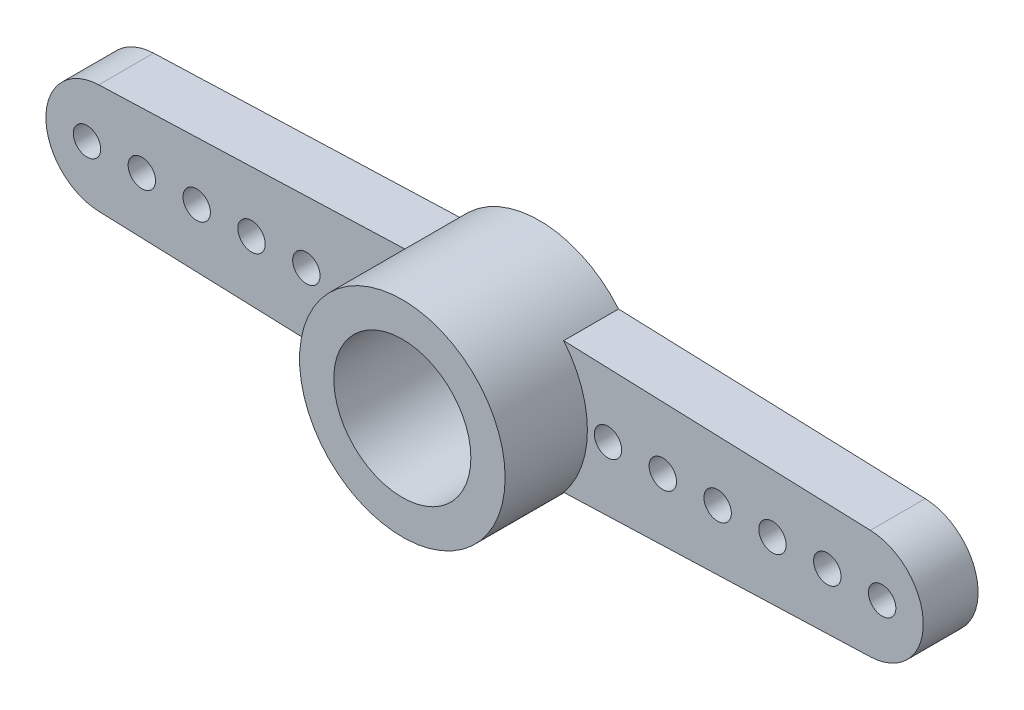
ISO-10303-21;
HEADER;
FILE_DESCRIPTION(('STEP AP214'),'2;1');
FILE_NAME('part.step','',(''),(''),'','','');
FILE_SCHEMA(('AUTOMOTIVE_DESIGN { 1 0 10303 214 1 1 1 1 }'));
ENDSEC;
DATA;
#1=APPLICATION_CONTEXT('core data for automotive mechanical design processes');
#2=APPLICATION_PROTOCOL_DEFINITION('international standard','automotive_design',2000,#1);
#3=PRODUCT_CONTEXT('',#1,'mechanical');
#4=PRODUCT('Part','Part','',(#3));
#5=PRODUCT_RELATED_PRODUCT_CATEGORY('part','',(#4));
#6=PRODUCT_DEFINITION_FORMATION('','',#4);
#7=PRODUCT_DEFINITION_CONTEXT('part definition',#1,'design');
#8=PRODUCT_DEFINITION('design','',#6,#7);
#9=PRODUCT_DEFINITION_SHAPE('','',#8);
#10=(LENGTH_UNIT() NAMED_UNIT(*) SI_UNIT(.MILLI.,.METRE.));
#11=(NAMED_UNIT(*) PLANE_ANGLE_UNIT() SI_UNIT($,.RADIAN.));
#12=(NAMED_UNIT(*) SI_UNIT($,.STERADIAN.) SOLID_ANGLE_UNIT());
#13=UNCERTAINTY_MEASURE_WITH_UNIT(LENGTH_MEASURE(1.E-05),#10,'distance_accuracy_value','');
#14=(GEOMETRIC_REPRESENTATION_CONTEXT(3) GLOBAL_UNCERTAINTY_ASSIGNED_CONTEXT((#13)) GLOBAL_UNIT_ASSIGNED_CONTEXT((#10,
#11,#12)) REPRESENTATION_CONTEXT('',''));
#15=CARTESIAN_POINT('',(0.,0.,0.));
#16=DIRECTION('',(0.,0.,1.));
#17=DIRECTION('',(1.,0.,0.));
#18=AXIS2_PLACEMENT_3D('',#15,#16,#17);
#19=CARTESIAN_POINT('',(0.,0.,0.));
#20=DIRECTION('',(0.,0.,1.));
#21=DIRECTION('',(1.,0.,0.));
#22=AXIS2_PLACEMENT_3D('',#19,#20,#21);
#23=CYLINDRICAL_SURFACE('',#22,2.5);
#24=CARTESIAN_POINT('',(0.,0.,5.));
#25=DIRECTION('',(0.,0.,1.));
#26=DIRECTION('',(1.,0.,0.));
#27=AXIS2_PLACEMENT_3D('',#24,#25,#26);
#28=CIRCLE('',#27,2.5);
#29=CARTESIAN_POINT('',(2.5,0.,5.));
#30=VERTEX_POINT('',#29);
#31=EDGE_CURVE('E540',#30,#30,#28,.T.);
#32=ORIENTED_EDGE('',*,*,#31,.T.);
#33=EDGE_LOOP('',(#32));
#34=FACE_BOUND('',#33,.T.);
#35=CARTESIAN_POINT('',(0.,0.,1.));
#36=DIRECTION('',(0.,0.,-1.));
#37=DIRECTION('',(-1.,0.,0.));
#38=AXIS2_PLACEMENT_3D('',#35,#36,#37);
#39=CIRCLE('',#38,2.5);
#40=CARTESIAN_POINT('',(-2.5,0.,1.));
#41=VERTEX_POINT('',#40);
#42=EDGE_CURVE('E466',#41,#41,#39,.T.);
#43=ORIENTED_EDGE('',*,*,#42,.T.);
#44=EDGE_LOOP('',(#43));
#45=FACE_BOUND('',#44,.T.);
#46=ADVANCED_FACE('F42',(#34,#45),#23,.F.);
#47=CARTESIAN_POINT('',(0.,0.,2.));
#48=DIRECTION('',(0.,0.,1.));
#49=DIRECTION('',(1.,0.,0.));
#50=AXIS2_PLACEMENT_3D('',#47,#48,#49);
#51=PLANE('',#50);
#52=CARTESIAN_POINT('',(-12.5,0.,2.));
#53=DIRECTION('',(0.,0.,-1.));
#54=DIRECTION('',(-1.,0.,0.));
#55=AXIS2_PLACEMENT_3D('',#52,#53,#54);
#56=CIRCLE('',#55,0.500000000000001);
#57=CARTESIAN_POINT('',(-13.,0.,2.));
#58=VERTEX_POINT('',#57);
#59=EDGE_CURVE('E480',#58,#58,#56,.F.);
#60=ORIENTED_EDGE('',*,*,#59,.F.);
#61=EDGE_LOOP('',(#60));
#62=FACE_BOUND('',#61,.T.);
#63=CARTESIAN_POINT('',(-8.5,0.,2.));
#64=DIRECTION('',(0.,0.,-1.));
#65=DIRECTION('',(-1.,0.,0.));
#66=AXIS2_PLACEMENT_3D('',#63,#64,#65);
#67=CIRCLE('',#66,0.500000000000001);
#68=CARTESIAN_POINT('',(-9.,0.,2.));
#69=VERTEX_POINT('',#68);
#70=EDGE_CURVE('E492',#69,#69,#67,.F.);
#71=ORIENTED_EDGE('',*,*,#70,.F.);
#72=EDGE_LOOP('',(#71));
#73=FACE_BOUND('',#72,.T.);
#74=CARTESIAN_POINT('',(-4.5,0.,2.));
#75=DIRECTION('',(0.,0.,-1.));
#76=DIRECTION('',(-1.,0.,0.));
#77=AXIS2_PLACEMENT_3D('',#74,#75,#76);
#78=CIRCLE('',#77,0.500000000000001);
#79=CARTESIAN_POINT('',(-5.,0.,2.));
#80=VERTEX_POINT('',#79);
#81=EDGE_CURVE('E504',#80,#80,#78,.F.);
#82=ORIENTED_EDGE('',*,*,#81,.F.);
#83=EDGE_LOOP('',(#82));
#84=FACE_BOUND('',#83,.T.);
#85=CARTESIAN_POINT('',(0.,0.,2.));
#86=DIRECTION('',(0.,0.,1.));
#87=DIRECTION('',(1.,0.,0.));
#88=AXIS2_PLACEMENT_3D('',#85,#86,#87);
#89=CIRCLE('',#88,3.75);
#90=CARTESIAN_POINT('',(-2.88547071027724,2.39511143376089,2.));
#91=VERTEX_POINT('',#90);
#92=CARTESIAN_POINT('',(-2.88547071027724,-2.39511143376089,2.));
#93=VERTEX_POINT('',#92);
#94=EDGE_CURVE('E12',#91,#93,#89,.T.);
#95=ORIENTED_EDGE('',*,*,#94,.F.);
#96=DIRECTION('',(0.999372730394994,0.0354139201848026,0.));
#97=VECTOR('',#96,1.);
#98=CARTESIAN_POINT('',(-0.0883858807695831,2.49422934631706,2.));
#99=LINE('',#98,#97);
#100=CARTESIAN_POINT('',(-14.0708278403696,1.99874546078999,2.));
#101=VERTEX_POINT('',#100);
#102=EDGE_CURVE('E187',#101,#91,#99,.T.);
#103=ORIENTED_EDGE('',*,*,#102,.F.);
#104=CARTESIAN_POINT('',(-14.,0.,2.));
#105=DIRECTION('',(0.,0.,1.));
#106=DIRECTION('',(1.,0.,0.));
#107=AXIS2_PLACEMENT_3D('',#104,#105,#106);
#108=CIRCLE('',#107,2.);
#109=CARTESIAN_POINT('',(-14.0708278403696,-1.99874546078999,2.));
#110=VERTEX_POINT('',#109);
#111=EDGE_CURVE('E180',#110,#101,#108,.F.);
#112=ORIENTED_EDGE('',*,*,#111,.F.);
#113=DIRECTION('',(0.999372730394994,-0.0354139201848024,0.));
#114=VECTOR('',#113,1.);
#115=CARTESIAN_POINT('',(-0.0883858807695825,-2.49422934631706,2.));
#116=LINE('',#115,#114);
#117=EDGE_CURVE('E184',#110,#93,#116,.T.);
#118=ORIENTED_EDGE('',*,*,#117,.T.);
#119=EDGE_LOOP('',(#95,#103,#112,#118));
#120=FACE_BOUND('',#119,.T.);
#121=CARTESIAN_POINT('',(-6.5,0.,2.));
#122=DIRECTION('',(0.,0.,-1.));
#123=DIRECTION('',(-1.,0.,0.));
#124=AXIS2_PLACEMENT_3D('',#121,#122,#123);
#125=CIRCLE('',#124,0.500000000000001);
#126=CARTESIAN_POINT('',(-7.,0.,2.));
#127=VERTEX_POINT('',#126);
#128=EDGE_CURVE('E498',#127,#127,#125,.F.);
#129=ORIENTED_EDGE('',*,*,#128,.F.);
#130=EDGE_LOOP('',(#129));
#131=FACE_BOUND('',#130,.T.);
#132=CARTESIAN_POINT('',(-10.5,0.,2.));
#133=DIRECTION('',(0.,0.,-1.));
#134=DIRECTION('',(-1.,0.,0.));
#135=AXIS2_PLACEMENT_3D('',#132,#133,#134);
#136=CIRCLE('',#135,0.500000000000001);
#137=CARTESIAN_POINT('',(-11.,0.,2.));
#138=VERTEX_POINT('',#137);
#139=EDGE_CURVE('E486',#138,#138,#136,.F.);
#140=ORIENTED_EDGE('',*,*,#139,.F.);
#141=EDGE_LOOP('',(#140));
#142=FACE_BOUND('',#141,.T.);
#143=CARTESIAN_POINT('',(-14.5,0.,2.));
#144=DIRECTION('',(0.,0.,-1.));
#145=DIRECTION('',(-1.,0.,0.));
#146=AXIS2_PLACEMENT_3D('',#143,#144,#145);
#147=CIRCLE('',#146,0.500000000000001);
#148=CARTESIAN_POINT('',(-15.,0.,2.));
#149=VERTEX_POINT('',#148);
#150=EDGE_CURVE('E474',#149,#149,#147,.F.);
#151=ORIENTED_EDGE('',*,*,#150,.F.);
#152=EDGE_LOOP('',(#151));
#153=FACE_BOUND('',#152,.T.);
#154=ADVANCED_FACE('F188',(#62,#73,#84,#120,#131,#142,#153),#51,.T.);
#155=CARTESIAN_POINT('',(0.,0.,0.));
#156=DIRECTION('',(0.,0.,1.));
#157=DIRECTION('',(1.,0.,0.));
#158=AXIS2_PLACEMENT_3D('',#155,#156,#157);
#159=PLANE('',#158);
#160=CARTESIAN_POINT('',(0.,0.,0.));
#161=DIRECTION('',(0.,0.,-1.));
#162=DIRECTION('',(-1.,0.,0.));
#163=AXIS2_PLACEMENT_3D('',#160,#161,#162);
#164=CIRCLE('',#163,2.5);
#165=CARTESIAN_POINT('',(-2.5,0.,0.));
#166=VERTEX_POINT('',#165);
#167=EDGE_CURVE('E458',#166,#166,#164,.T.);
#168=ORIENTED_EDGE('',*,*,#167,.F.);
#169=EDGE_LOOP('',(#168));
#170=FACE_BOUND('',#169,.T.);
#171=CARTESIAN_POINT('',(12.5,0.,0.));
#172=DIRECTION('',(0.,0.,-1.));
#173=DIRECTION('',(-1.,0.,0.));
#174=AXIS2_PLACEMENT_3D('',#171,#172,#173);
#175=CIRCLE('',#174,0.500000000000001);
#176=CARTESIAN_POINT('',(12.,0.,0.));
#177=VERTEX_POINT('',#176);
#178=EDGE_CURVE('E471',#177,#177,#175,.T.);
#179=ORIENTED_EDGE('',*,*,#178,.F.);
#180=EDGE_LOOP('',(#179));
#181=FACE_BOUND('',#180,.T.);
#182=CARTESIAN_POINT('',(-12.5,0.,0.));
#183=DIRECTION('',(0.,0.,-1.));
#184=DIRECTION('',(-1.,0.,0.));
#185=AXIS2_PLACEMENT_3D('',#182,#183,#184);
#186=CIRCLE('',#185,0.500000000000001);
#187=CARTESIAN_POINT('',(-13.,0.,0.));
#188=VERTEX_POINT('',#187);
#189=EDGE_CURVE('E483',#188,#188,#186,.F.);
#190=ORIENTED_EDGE('',*,*,#189,.T.);
#191=EDGE_LOOP('',(#190));
#192=FACE_BOUND('',#191,.T.);
#193=CARTESIAN_POINT('',(-8.5,0.,0.));
#194=DIRECTION('',(0.,0.,-1.));
#195=DIRECTION('',(-1.,0.,0.));
#196=AXIS2_PLACEMENT_3D('',#193,#194,#195);
#197=CIRCLE('',#196,0.500000000000001);
#198=CARTESIAN_POINT('',(-9.,0.,0.));
#199=VERTEX_POINT('',#198);
#200=EDGE_CURVE('E495',#199,#199,#197,.F.);
#201=ORIENTED_EDGE('',*,*,#200,.T.);
#202=EDGE_LOOP('',(#201));
#203=FACE_BOUND('',#202,.T.);
#204=CARTESIAN_POINT('',(-4.5,0.,0.));
#205=DIRECTION('',(0.,0.,-1.));
#206=DIRECTION('',(-1.,0.,0.));
#207=AXIS2_PLACEMENT_3D('',#204,#205,#206);
#208=CIRCLE('',#207,0.500000000000001);
#209=CARTESIAN_POINT('',(-5.,0.,0.));
#210=VERTEX_POINT('',#209);
#211=EDGE_CURVE('E507',#210,#210,#208,.F.);
#212=ORIENTED_EDGE('',*,*,#211,.T.);
#213=EDGE_LOOP('',(#212));
#214=FACE_BOUND('',#213,.T.);
#215=CARTESIAN_POINT('',(4.5,0.,0.));
#216=DIRECTION('',(0.,0.,-1.));
#217=DIRECTION('',(-1.,0.,0.));
#218=AXIS2_PLACEMENT_3D('',#215,#216,#217);
#219=CIRCLE('',#218,0.500000000000001);
#220=CARTESIAN_POINT('',(4.,0.,0.));
#221=VERTEX_POINT('',#220);
#222=EDGE_CURVE('E513',#221,#221,#219,.T.);
#223=ORIENTED_EDGE('',*,*,#222,.F.);
#224=EDGE_LOOP('',(#223));
#225=FACE_BOUND('',#224,.T.);
#226=CARTESIAN_POINT('',(6.5,0.,0.));
#227=DIRECTION('',(0.,0.,-1.));
#228=DIRECTION('',(-1.,0.,0.));
#229=AXIS2_PLACEMENT_3D('',#226,#227,#228);
#230=CIRCLE('',#229,0.500000000000001);
#231=CARTESIAN_POINT('',(6.,0.,0.));
#232=VERTEX_POINT('',#231);
#233=EDGE_CURVE('E519',#232,#232,#230,.T.);
#234=ORIENTED_EDGE('',*,*,#233,.F.);
#235=EDGE_LOOP('',(#234));
#236=FACE_BOUND('',#235,.T.);
#237=CARTESIAN_POINT('',(8.5,0.,0.));
#238=DIRECTION('',(0.,0.,-1.));
#239=DIRECTION('',(-1.,0.,0.));
#240=AXIS2_PLACEMENT_3D('',#237,#238,#239);
#241=CIRCLE('',#240,0.500000000000001);
#242=CARTESIAN_POINT('',(8.,0.,0.));
#243=VERTEX_POINT('',#242);
#244=EDGE_CURVE('E525',#243,#243,#241,.T.);
#245=ORIENTED_EDGE('',*,*,#244,.F.);
#246=EDGE_LOOP('',(#245));
#247=FACE_BOUND('',#246,.T.);
#248=CARTESIAN_POINT('',(10.5,0.,0.));
#249=DIRECTION('',(0.,0.,-1.));
#250=DIRECTION('',(-1.,0.,0.));
#251=AXIS2_PLACEMENT_3D('',#248,#249,#250);
#252=CIRCLE('',#251,0.500000000000001);
#253=CARTESIAN_POINT('',(10.,0.,0.));
#254=VERTEX_POINT('',#253);
#255=EDGE_CURVE('E531',#254,#254,#252,.T.);
#256=ORIENTED_EDGE('',*,*,#255,.F.);
#257=EDGE_LOOP('',(#256));
#258=FACE_BOUND('',#257,.T.);
#259=CARTESIAN_POINT('',(14.5,0.,0.));
#260=DIRECTION('',(0.,0.,-1.));
#261=DIRECTION('',(-1.,0.,0.));
#262=AXIS2_PLACEMENT_3D('',#259,#260,#261);
#263=CIRCLE('',#262,0.500000000000001);
#264=CARTESIAN_POINT('',(14.,0.,0.));
#265=VERTEX_POINT('',#264);
#266=EDGE_CURVE('E534',#265,#265,#263,.T.);
#267=ORIENTED_EDGE('',*,*,#266,.F.);
#268=EDGE_LOOP('',(#267));
#269=FACE_BOUND('',#268,.T.);
#270=DIRECTION('',(-0.999372730394994,-0.0354139201848029,0.));
#271=VECTOR('',#270,1.);
#272=CARTESIAN_POINT('',(0.0883858807695838,-2.49422934631706,0.));
#273=LINE('',#272,#271);
#274=CARTESIAN_POINT('',(14.0708278403696,-1.99874546078998,0.));
#275=VERTEX_POINT('',#274);
#276=CARTESIAN_POINT('',(2.88547071027724,-2.39511143376089,0.));
#277=VERTEX_POINT('',#276);
#278=EDGE_CURVE('E116',#275,#277,#273,.T.);
#279=ORIENTED_EDGE('',*,*,#278,.T.);
#280=CARTESIAN_POINT('',(0.,0.,0.));
#281=DIRECTION('',(0.,0.,-1.));
#282=DIRECTION('',(-1.,0.,0.));
#283=AXIS2_PLACEMENT_3D('',#280,#281,#282);
#284=CIRCLE('',#283,3.75);
#285=CARTESIAN_POINT('',(-2.88547071027724,-2.39511143376089,0.));
#286=VERTEX_POINT('',#285);
#287=EDGE_CURVE('E93',#277,#286,#284,.T.);
#288=ORIENTED_EDGE('',*,*,#287,.T.);
#289=DIRECTION('',(0.999372730394994,-0.0354139201848024,0.));
#290=VECTOR('',#289,1.);
#291=CARTESIAN_POINT('',(-0.0883858807695825,-2.49422934631706,0.));
#292=LINE('',#291,#290);
#293=CARTESIAN_POINT('',(-14.0708278403696,-1.99874546078999,0.));
#294=VERTEX_POINT('',#293);
#295=EDGE_CURVE('E150',#294,#286,#292,.T.);
#296=ORIENTED_EDGE('',*,*,#295,.F.);
#297=CARTESIAN_POINT('',(-14.,0.,0.));
#298=DIRECTION('',(0.,0.,1.));
#299=DIRECTION('',(1.,0.,0.));
#300=AXIS2_PLACEMENT_3D('',#297,#298,#299);
#301=CIRCLE('',#300,2.);
#302=CARTESIAN_POINT('',(-14.0708278403696,1.99874546078999,0.));
#303=VERTEX_POINT('',#302);
#304=EDGE_CURVE('E182',#294,#303,#301,.F.);
#305=ORIENTED_EDGE('',*,*,#304,.T.);
#306=DIRECTION('',(0.999372730394994,0.0354139201848026,0.));
#307=VECTOR('',#306,1.);
#308=CARTESIAN_POINT('',(-0.0883858807695831,2.49422934631706,0.));
#309=LINE('',#308,#307);
#310=CARTESIAN_POINT('',(-2.88547071027724,2.39511143376089,0.));
#311=VERTEX_POINT('',#310);
#312=EDGE_CURVE('E59',#303,#311,#309,.T.);
#313=ORIENTED_EDGE('',*,*,#312,.T.);
#314=CARTESIAN_POINT('',(2.88547071027724,2.39511143376089,0.));
#315=VERTEX_POINT('',#314);
#316=EDGE_CURVE('E83',#311,#315,#284,.T.);
#317=ORIENTED_EDGE('',*,*,#316,.T.);
#318=DIRECTION('',(-0.999372730394994,0.0354139201848023,0.));
#319=VECTOR('',#318,1.);
#320=CARTESIAN_POINT('',(0.0883858807695825,2.49422934631706,0.));
#321=LINE('',#320,#319);
#322=CARTESIAN_POINT('',(14.0708278403696,1.99874546078999,0.));
#323=VERTEX_POINT('',#322);
#324=EDGE_CURVE('E90',#323,#315,#321,.T.);
#325=ORIENTED_EDGE('',*,*,#324,.F.);
#326=CARTESIAN_POINT('',(14.,0.,0.));
#327=DIRECTION('',(0.,0.,1.));
#328=DIRECTION('',(1.,0.,0.));
#329=AXIS2_PLACEMENT_3D('',#326,#327,#328);
#330=CIRCLE('',#329,2.);
#331=EDGE_CURVE('E112',#275,#323,#330,.T.);
#332=ORIENTED_EDGE('',*,*,#331,.F.);
#333=EDGE_LOOP('',(#279,#288,#296,#305,#313,#317,#325,#332));
#334=FACE_BOUND('',#333,.T.);
#335=CARTESIAN_POINT('',(-6.5,0.,0.));
#336=DIRECTION('',(0.,0.,-1.));
#337=DIRECTION('',(-1.,0.,0.));
#338=AXIS2_PLACEMENT_3D('',#335,#336,#337);
#339=CIRCLE('',#338,0.500000000000001);
#340=CARTESIAN_POINT('',(-7.,0.,0.));
#341=VERTEX_POINT('',#340);
#342=EDGE_CURVE('E501',#341,#341,#339,.F.);
#343=ORIENTED_EDGE('',*,*,#342,.T.);
#344=EDGE_LOOP('',(#343));
#345=FACE_BOUND('',#344,.T.);
#346=CARTESIAN_POINT('',(-10.5,0.,0.));
#347=DIRECTION('',(0.,0.,-1.));
#348=DIRECTION('',(-1.,0.,0.));
#349=AXIS2_PLACEMENT_3D('',#346,#347,#348);
#350=CIRCLE('',#349,0.500000000000001);
#351=CARTESIAN_POINT('',(-11.,0.,0.));
#352=VERTEX_POINT('',#351);
#353=EDGE_CURVE('E489',#352,#352,#350,.F.);
#354=ORIENTED_EDGE('',*,*,#353,.T.);
#355=EDGE_LOOP('',(#354));
#356=FACE_BOUND('',#355,.T.);
#357=CARTESIAN_POINT('',(-14.5,0.,0.));
#358=DIRECTION('',(0.,0.,-1.));
#359=DIRECTION('',(-1.,0.,0.));
#360=AXIS2_PLACEMENT_3D('',#357,#358,#359);
#361=CIRCLE('',#360,0.500000000000001);
#362=CARTESIAN_POINT('',(-15.,0.,0.));
#363=VERTEX_POINT('',#362);
#364=EDGE_CURVE('E477',#363,#363,#361,.F.);
#365=ORIENTED_EDGE('',*,*,#364,.T.);
#366=EDGE_LOOP('',(#365));
#367=FACE_BOUND('',#366,.T.);
#368=ADVANCED_FACE('F86',(#170,#181,#192,#203,#214,#225,#236,#247,#258,#269,#334,#345,#356,
#367),#159,.F.);
#369=CARTESIAN_POINT('',(0.0883858807695838,-2.49422934631706,2.));
#370=DIRECTION('',(0.0354139201848029,-0.999372730394994,0.));
#371=DIRECTION('',(0.999372730394994,0.0354139201848029,0.));
#372=AXIS2_PLACEMENT_3D('',#369,#370,#371);
#373=PLANE('',#372);
#374=ORIENTED_EDGE('',*,*,#278,.F.);
#375=DIRECTION('',(0.,0.,-1.));
#376=VECTOR('',#375,1.);
#377=CARTESIAN_POINT('',(14.0708278403696,-1.99874546078998,2.));
#378=LINE('',#377,#376);
#379=CARTESIAN_POINT('',(14.0708278403696,-1.99874546078998,2.));
#380=VERTEX_POINT('',#379);
#381=EDGE_CURVE('E121',#380,#275,#378,.T.);
#382=ORIENTED_EDGE('',*,*,#381,.F.);
#383=DIRECTION('',(-0.999372730394994,-0.0354139201848029,0.));
#384=VECTOR('',#383,1.);
#385=CARTESIAN_POINT('',(0.0883858807695838,-2.49422934631706,2.));
#386=LINE('',#385,#384);
#387=CARTESIAN_POINT('',(2.88547071027724,-2.39511143376089,2.));
#388=VERTEX_POINT('',#387);
#389=EDGE_CURVE('E111',#380,#388,#386,.T.);
#390=ORIENTED_EDGE('',*,*,#389,.T.);
#391=DIRECTION('',(0.,0.,-1.));
#392=VECTOR('',#391,1.);
#393=CARTESIAN_POINT('',(2.88547071027724,-2.39511143376089,2.));
#394=LINE('',#393,#392);
#395=EDGE_CURVE('E107',#388,#277,#394,.T.);
#396=ORIENTED_EDGE('',*,*,#395,.T.);
#397=EDGE_LOOP('',(#374,#382,#390,#396));
#398=FACE_BOUND('',#397,.T.);
#399=ADVANCED_FACE('F44',(#398),#373,.T.);
#400=CARTESIAN_POINT('',(14.,0.,2.));
#401=DIRECTION('',(0.,0.,-1.));
#402=DIRECTION('',(-1.,0.,0.));
#403=AXIS2_PLACEMENT_3D('',#400,#401,#402);
#404=CYLINDRICAL_SURFACE('',#403,2.);
#405=ORIENTED_EDGE('',*,*,#331,.T.);
#406=DIRECTION('',(0.,0.,-1.));
#407=VECTOR('',#406,1.);
#408=CARTESIAN_POINT('',(14.0708278403696,1.99874546078999,2.));
#409=LINE('',#408,#407);
#410=CARTESIAN_POINT('',(14.0708278403696,1.99874546078999,2.));
#411=VERTEX_POINT('',#410);
#412=EDGE_CURVE('E106',#411,#323,#409,.T.);
#413=ORIENTED_EDGE('',*,*,#412,.F.);
#414=CARTESIAN_POINT('',(14.,0.,2.));
#415=DIRECTION('',(0.,0.,1.));
#416=DIRECTION('',(1.,0.,0.));
#417=AXIS2_PLACEMENT_3D('',#414,#415,#416);
#418=CIRCLE('',#417,2.);
#419=EDGE_CURVE('E68',#380,#411,#418,.T.);
#420=ORIENTED_EDGE('',*,*,#419,.F.);
#421=ORIENTED_EDGE('',*,*,#381,.T.);
#422=EDGE_LOOP('',(#405,#413,#420,#421));
#423=FACE_BOUND('',#422,.T.);
#424=ADVANCED_FACE('F243',(#423),#404,.T.);
#425=CARTESIAN_POINT('',(0.0883858807695825,2.49422934631706,2.));
#426=DIRECTION('',(-0.0354139201848023,-0.999372730394994,0.));
#427=DIRECTION('',(0.999372730394994,-0.0354139201848023,0.));
#428=AXIS2_PLACEMENT_3D('',#425,#426,#427);
#429=PLANE('',#428);
#430=ORIENTED_EDGE('',*,*,#324,.T.);
#431=DIRECTION('',(0.,0.,-1.));
#432=VECTOR('',#431,1.);
#433=CARTESIAN_POINT('',(2.88547071027724,2.39511143376089,2.));
#434=LINE('',#433,#432);
#435=CARTESIAN_POINT('',(2.88547071027724,2.39511143376089,2.));
#436=VERTEX_POINT('',#435);
#437=EDGE_CURVE('E98',#436,#315,#434,.T.);
#438=ORIENTED_EDGE('',*,*,#437,.F.);
#439=DIRECTION('',(-0.999372730394994,0.0354139201848023,0.));
#440=VECTOR('',#439,1.);
#441=CARTESIAN_POINT('',(0.0883858807695825,2.49422934631706,2.));
#442=LINE('',#441,#440);
#443=EDGE_CURVE('E135',#411,#436,#442,.T.);
#444=ORIENTED_EDGE('',*,*,#443,.F.);
#445=ORIENTED_EDGE('',*,*,#412,.T.);
#446=EDGE_LOOP('',(#430,#438,#444,#445));
#447=FACE_BOUND('',#446,.T.);
#448=ADVANCED_FACE('F110',(#447),#429,.F.);
#449=CARTESIAN_POINT('',(12.5,0.,2.));
#450=DIRECTION('',(0.,0.,-1.));
#451=DIRECTION('',(-1.,0.,0.));
#452=AXIS2_PLACEMENT_3D('',#449,#450,#451);
#453=CIRCLE('',#452,0.500000000000001);
#454=CARTESIAN_POINT('',(12.,0.,2.));
#455=VERTEX_POINT('',#454);
#456=EDGE_CURVE('E470',#455,#455,#453,.T.);
#457=ORIENTED_EDGE('',*,*,#456,.T.);
#458=EDGE_LOOP('',(#457));
#459=FACE_BOUND('',#458,.T.);
#460=CARTESIAN_POINT('',(4.5,0.,2.));
#461=DIRECTION('',(0.,0.,-1.));
#462=DIRECTION('',(-1.,0.,0.));
#463=AXIS2_PLACEMENT_3D('',#460,#461,#462);
#464=CIRCLE('',#463,0.500000000000001);
#465=CARTESIAN_POINT('',(4.,0.,2.));
#466=VERTEX_POINT('',#465);
#467=EDGE_CURVE('E510',#466,#466,#464,.T.);
#468=ORIENTED_EDGE('',*,*,#467,.T.);
#469=EDGE_LOOP('',(#468));
#470=FACE_BOUND('',#469,.T.);
#471=CARTESIAN_POINT('',(6.5,0.,2.));
#472=DIRECTION('',(0.,0.,-1.));
#473=DIRECTION('',(-1.,0.,0.));
#474=AXIS2_PLACEMENT_3D('',#471,#472,#473);
#475=CIRCLE('',#474,0.500000000000001);
#476=CARTESIAN_POINT('',(6.,0.,2.));
#477=VERTEX_POINT('',#476);
#478=EDGE_CURVE('E516',#477,#477,#475,.T.);
#479=ORIENTED_EDGE('',*,*,#478,.T.);
#480=EDGE_LOOP('',(#479));
#481=FACE_BOUND('',#480,.T.);
#482=CARTESIAN_POINT('',(8.5,0.,2.));
#483=DIRECTION('',(0.,0.,-1.));
#484=DIRECTION('',(-1.,0.,0.));
#485=AXIS2_PLACEMENT_3D('',#482,#483,#484);
#486=CIRCLE('',#485,0.500000000000001);
#487=CARTESIAN_POINT('',(8.,0.,2.));
#488=VERTEX_POINT('',#487);
#489=EDGE_CURVE('E522',#488,#488,#486,.T.);
#490=ORIENTED_EDGE('',*,*,#489,.T.);
#491=EDGE_LOOP('',(#490));
#492=FACE_BOUND('',#491,.T.);
#493=CARTESIAN_POINT('',(10.5,0.,2.));
#494=DIRECTION('',(0.,0.,-1.));
#495=DIRECTION('',(-1.,0.,0.));
#496=AXIS2_PLACEMENT_3D('',#493,#494,#495);
#497=CIRCLE('',#496,0.500000000000001);
#498=CARTESIAN_POINT('',(10.,0.,2.));
#499=VERTEX_POINT('',#498);
#500=EDGE_CURVE('E528',#499,#499,#497,.T.);
#501=ORIENTED_EDGE('',*,*,#500,.T.);
#502=EDGE_LOOP('',(#501));
#503=FACE_BOUND('',#502,.T.);
#504=CARTESIAN_POINT('',(14.5,0.,2.));
#505=DIRECTION('',(0.,0.,-1.));
#506=DIRECTION('',(-1.,0.,0.));
#507=AXIS2_PLACEMENT_3D('',#504,#505,#506);
#508=CIRCLE('',#507,0.500000000000001);
#509=CARTESIAN_POINT('',(14.,0.,2.));
#510=VERTEX_POINT('',#509);
#511=EDGE_CURVE('E537',#510,#510,#508,.T.);
#512=ORIENTED_EDGE('',*,*,#511,.T.);
#513=EDGE_LOOP('',(#512));
#514=FACE_BOUND('',#513,.T.);
#515=EDGE_CURVE('E51',#388,#436,#89,.T.);
#516=ORIENTED_EDGE('',*,*,#515,.F.);
#517=ORIENTED_EDGE('',*,*,#389,.F.);
#518=ORIENTED_EDGE('',*,*,#419,.T.);
#519=ORIENTED_EDGE('',*,*,#443,.T.);
#520=EDGE_LOOP('',(#516,#517,#518,#519));
#521=FACE_BOUND('',#520,.T.);
#522=ADVANCED_FACE('F230',(#459,#470,#481,#492,#503,#514,#521),#51,.T.);
#523=CARTESIAN_POINT('',(0.,0.,0.));
#524=DIRECTION('',(0.,0.,1.));
#525=DIRECTION('',(1.,0.,0.));
#526=AXIS2_PLACEMENT_3D('',#523,#524,#525);
#527=CYLINDRICAL_SURFACE('',#526,3.75);
#528=ORIENTED_EDGE('',*,*,#316,.F.);
#529=DIRECTION('',(0.,0.,-1.));
#530=VECTOR('',#529,1.);
#531=CARTESIAN_POINT('',(-2.88547071027724,2.39511143376089,2.));
#532=LINE('',#531,#530);
#533=EDGE_CURVE('E200',#91,#311,#532,.T.);
#534=ORIENTED_EDGE('',*,*,#533,.F.);
#535=ORIENTED_EDGE('',*,*,#94,.T.);
#536=DIRECTION('',(0.,0.,-1.));
#537=VECTOR('',#536,1.);
#538=CARTESIAN_POINT('',(-2.88547071027724,-2.39511143376089,2.));
#539=LINE('',#538,#537);
#540=EDGE_CURVE('E156',#93,#286,#539,.T.);
#541=ORIENTED_EDGE('',*,*,#540,.T.);
#542=ORIENTED_EDGE('',*,*,#287,.F.);
#543=ORIENTED_EDGE('',*,*,#395,.F.);
#544=ORIENTED_EDGE('',*,*,#515,.T.);
#545=ORIENTED_EDGE('',*,*,#437,.T.);
#546=EDGE_LOOP('',(#528,#534,#535,#541,#542,#543,#544,#545));
#547=FACE_BOUND('',#546,.T.);
#548=CARTESIAN_POINT('',(0.,0.,5.));
#549=DIRECTION('',(0.,0.,1.));
#550=DIRECTION('',(1.,0.,0.));
#551=AXIS2_PLACEMENT_3D('',#548,#549,#550);
#552=CIRCLE('',#551,3.75);
#553=CARTESIAN_POINT('',(3.75,0.,5.));
#554=VERTEX_POINT('',#553);
#555=EDGE_CURVE('E195',#554,#554,#552,.T.);
#556=ORIENTED_EDGE('',*,*,#555,.F.);
#557=EDGE_LOOP('',(#556));
#558=FACE_BOUND('',#557,.T.);
#559=ADVANCED_FACE('F99',(#547,#558),#527,.T.);
#560=CARTESIAN_POINT('',(-14.,0.,2.));
#561=DIRECTION('',(0.,0.,-1.));
#562=DIRECTION('',(-1.,0.,0.));
#563=AXIS2_PLACEMENT_3D('',#560,#561,#562);
#564=CYLINDRICAL_SURFACE('',#563,2.);
#565=ORIENTED_EDGE('',*,*,#304,.F.);
#566=DIRECTION('',(0.,0.,-1.));
#567=VECTOR('',#566,1.);
#568=CARTESIAN_POINT('',(-14.0708278403696,-1.99874546078999,2.));
#569=LINE('',#568,#567);
#570=EDGE_CURVE('E94',#110,#294,#569,.T.);
#571=ORIENTED_EDGE('',*,*,#570,.F.);
#572=ORIENTED_EDGE('',*,*,#111,.T.);
#573=DIRECTION('',(0.,0.,-1.));
#574=VECTOR('',#573,1.);
#575=CARTESIAN_POINT('',(-14.0708278403696,1.99874546078999,2.));
#576=LINE('',#575,#574);
#577=EDGE_CURVE('E199',#101,#303,#576,.T.);
#578=ORIENTED_EDGE('',*,*,#577,.T.);
#579=EDGE_LOOP('',(#565,#571,#572,#578));
#580=FACE_BOUND('',#579,.T.);
#581=ADVANCED_FACE('F178',(#580),#564,.T.);
#582=CARTESIAN_POINT('',(-0.0883858807695825,-2.49422934631706,2.));
#583=DIRECTION('',(0.0354139201848024,0.999372730394994,0.));
#584=DIRECTION('',(-0.999372730394994,0.0354139201848024,0.));
#585=AXIS2_PLACEMENT_3D('',#582,#583,#584);
#586=PLANE('',#585);
#587=ORIENTED_EDGE('',*,*,#295,.T.);
#588=ORIENTED_EDGE('',*,*,#540,.F.);
#589=ORIENTED_EDGE('',*,*,#117,.F.);
#590=ORIENTED_EDGE('',*,*,#570,.T.);
#591=EDGE_LOOP('',(#587,#588,#589,#590));
#592=FACE_BOUND('',#591,.T.);
#593=ADVANCED_FACE('F185',(#592),#586,.F.);
#594=CARTESIAN_POINT('',(-0.0883858807695831,2.49422934631706,2.));
#595=DIRECTION('',(-0.0354139201848026,0.999372730394994,0.));
#596=DIRECTION('',(-0.999372730394994,-0.0354139201848026,0.));
#597=AXIS2_PLACEMENT_3D('',#594,#595,#596);
#598=PLANE('',#597);
#599=ORIENTED_EDGE('',*,*,#312,.F.);
#600=ORIENTED_EDGE('',*,*,#577,.F.);
#601=ORIENTED_EDGE('',*,*,#102,.T.);
#602=ORIENTED_EDGE('',*,*,#533,.T.);
#603=EDGE_LOOP('',(#599,#600,#601,#602));
#604=FACE_BOUND('',#603,.T.);
#605=ADVANCED_FACE('F210',(#604),#598,.T.);
#606=CARTESIAN_POINT('',(0.,0.,5.));
#607=DIRECTION('',(0.,0.,1.));
#608=DIRECTION('',(1.,0.,0.));
#609=AXIS2_PLACEMENT_3D('',#606,#607,#608);
#610=PLANE('',#609);
#611=ORIENTED_EDGE('',*,*,#555,.T.);
#612=EDGE_LOOP('',(#611));
#613=FACE_BOUND('',#612,.T.);
#614=ORIENTED_EDGE('',*,*,#31,.F.);
#615=EDGE_LOOP('',(#614));
#616=FACE_BOUND('',#615,.T.);
#617=ADVANCED_FACE('F212',(#613,#616),#610,.T.);
#618=CARTESIAN_POINT('',(14.5,0.,2.));
#619=DIRECTION('',(0.,0.,-1.));
#620=DIRECTION('',(-1.,0.,0.));
#621=AXIS2_PLACEMENT_3D('',#618,#619,#620);
#622=CYLINDRICAL_SURFACE('',#621,0.500000000000001);
#623=ORIENTED_EDGE('',*,*,#511,.F.);
#624=EDGE_LOOP('',(#623));
#625=FACE_BOUND('',#624,.T.);
#626=ORIENTED_EDGE('',*,*,#266,.T.);
#627=EDGE_LOOP('',(#626));
#628=FACE_BOUND('',#627,.T.);
#629=ADVANCED_FACE('F218',(#625,#628),#622,.F.);
#630=CARTESIAN_POINT('',(10.5,0.,2.));
#631=DIRECTION('',(0.,0.,-1.));
#632=DIRECTION('',(-1.,0.,0.));
#633=AXIS2_PLACEMENT_3D('',#630,#631,#632);
#634=CYLINDRICAL_SURFACE('',#633,0.500000000000001);
#635=ORIENTED_EDGE('',*,*,#500,.F.);
#636=EDGE_LOOP('',(#635));
#637=FACE_BOUND('',#636,.T.);
#638=ORIENTED_EDGE('',*,*,#255,.T.);
#639=EDGE_LOOP('',(#638));
#640=FACE_BOUND('',#639,.T.);
#641=ADVANCED_FACE('F283',(#637,#640),#634,.F.);
#642=CARTESIAN_POINT('',(8.5,0.,2.));
#643=DIRECTION('',(0.,0.,-1.));
#644=DIRECTION('',(-1.,0.,0.));
#645=AXIS2_PLACEMENT_3D('',#642,#643,#644);
#646=CYLINDRICAL_SURFACE('',#645,0.500000000000001);
#647=ORIENTED_EDGE('',*,*,#489,.F.);
#648=EDGE_LOOP('',(#647));
#649=FACE_BOUND('',#648,.T.);
#650=ORIENTED_EDGE('',*,*,#244,.T.);
#651=EDGE_LOOP('',(#650));
#652=FACE_BOUND('',#651,.T.);
#653=ADVANCED_FACE('F293',(#649,#652),#646,.F.);
#654=CARTESIAN_POINT('',(6.5,0.,2.));
#655=DIRECTION('',(0.,0.,-1.));
#656=DIRECTION('',(-1.,0.,0.));
#657=AXIS2_PLACEMENT_3D('',#654,#655,#656);
#658=CYLINDRICAL_SURFACE('',#657,0.500000000000001);
#659=ORIENTED_EDGE('',*,*,#478,.F.);
#660=EDGE_LOOP('',(#659));
#661=FACE_BOUND('',#660,.T.);
#662=ORIENTED_EDGE('',*,*,#233,.T.);
#663=EDGE_LOOP('',(#662));
#664=FACE_BOUND('',#663,.T.);
#665=ADVANCED_FACE('F303',(#661,#664),#658,.F.);
#666=CARTESIAN_POINT('',(4.5,0.,2.));
#667=DIRECTION('',(0.,0.,-1.));
#668=DIRECTION('',(-1.,0.,0.));
#669=AXIS2_PLACEMENT_3D('',#666,#667,#668);
#670=CYLINDRICAL_SURFACE('',#669,0.500000000000001);
#671=ORIENTED_EDGE('',*,*,#467,.F.);
#672=EDGE_LOOP('',(#671));
#673=FACE_BOUND('',#672,.T.);
#674=ORIENTED_EDGE('',*,*,#222,.T.);
#675=EDGE_LOOP('',(#674));
#676=FACE_BOUND('',#675,.T.);
#677=ADVANCED_FACE('F313',(#673,#676),#670,.F.);
#678=CARTESIAN_POINT('',(-4.5,0.,2.));
#679=DIRECTION('',(0.,0.,-1.));
#680=DIRECTION('',(-1.,0.,0.));
#681=AXIS2_PLACEMENT_3D('',#678,#679,#680);
#682=CYLINDRICAL_SURFACE('',#681,0.500000000000001);
#683=ORIENTED_EDGE('',*,*,#81,.T.);
#684=EDGE_LOOP('',(#683));
#685=FACE_BOUND('',#684,.T.);
#686=ORIENTED_EDGE('',*,*,#211,.F.);
#687=EDGE_LOOP('',(#686));
#688=FACE_BOUND('',#687,.T.);
#689=ADVANCED_FACE('F323',(#685,#688),#682,.F.);
#690=CARTESIAN_POINT('',(-6.5,0.,2.));
#691=DIRECTION('',(0.,0.,-1.));
#692=DIRECTION('',(-1.,0.,0.));
#693=AXIS2_PLACEMENT_3D('',#690,#691,#692);
#694=CYLINDRICAL_SURFACE('',#693,0.500000000000001);
#695=ORIENTED_EDGE('',*,*,#128,.T.);
#696=EDGE_LOOP('',(#695));
#697=FACE_BOUND('',#696,.T.);
#698=ORIENTED_EDGE('',*,*,#342,.F.);
#699=EDGE_LOOP('',(#698));
#700=FACE_BOUND('',#699,.T.);
#701=ADVANCED_FACE('F333',(#697,#700),#694,.F.);
#702=CARTESIAN_POINT('',(-8.5,0.,2.));
#703=DIRECTION('',(0.,0.,-1.));
#704=DIRECTION('',(-1.,0.,0.));
#705=AXIS2_PLACEMENT_3D('',#702,#703,#704);
#706=CYLINDRICAL_SURFACE('',#705,0.500000000000001);
#707=ORIENTED_EDGE('',*,*,#70,.T.);
#708=EDGE_LOOP('',(#707));
#709=FACE_BOUND('',#708,.T.);
#710=ORIENTED_EDGE('',*,*,#200,.F.);
#711=EDGE_LOOP('',(#710));
#712=FACE_BOUND('',#711,.T.);
#713=ADVANCED_FACE('F343',(#709,#712),#706,.F.);
#714=CARTESIAN_POINT('',(-10.5,0.,2.));
#715=DIRECTION('',(0.,0.,-1.));
#716=DIRECTION('',(-1.,0.,0.));
#717=AXIS2_PLACEMENT_3D('',#714,#715,#716);
#718=CYLINDRICAL_SURFACE('',#717,0.500000000000001);
#719=ORIENTED_EDGE('',*,*,#139,.T.);
#720=EDGE_LOOP('',(#719));
#721=FACE_BOUND('',#720,.T.);
#722=ORIENTED_EDGE('',*,*,#353,.F.);
#723=EDGE_LOOP('',(#722));
#724=FACE_BOUND('',#723,.T.);
#725=ADVANCED_FACE('F353',(#721,#724),#718,.F.);
#726=CARTESIAN_POINT('',(-12.5,0.,2.));
#727=DIRECTION('',(0.,0.,-1.));
#728=DIRECTION('',(-1.,0.,0.));
#729=AXIS2_PLACEMENT_3D('',#726,#727,#728);
#730=CYLINDRICAL_SURFACE('',#729,0.500000000000001);
#731=ORIENTED_EDGE('',*,*,#59,.T.);
#732=EDGE_LOOP('',(#731));
#733=FACE_BOUND('',#732,.T.);
#734=ORIENTED_EDGE('',*,*,#189,.F.);
#735=EDGE_LOOP('',(#734));
#736=FACE_BOUND('',#735,.T.);
#737=ADVANCED_FACE('F363',(#733,#736),#730,.F.);
#738=CARTESIAN_POINT('',(-14.5,0.,2.));
#739=DIRECTION('',(0.,0.,-1.));
#740=DIRECTION('',(-1.,0.,0.));
#741=AXIS2_PLACEMENT_3D('',#738,#739,#740);
#742=CYLINDRICAL_SURFACE('',#741,0.500000000000001);
#743=ORIENTED_EDGE('',*,*,#150,.T.);
#744=EDGE_LOOP('',(#743));
#745=FACE_BOUND('',#744,.T.);
#746=ORIENTED_EDGE('',*,*,#364,.F.);
#747=EDGE_LOOP('',(#746));
#748=FACE_BOUND('',#747,.T.);
#749=ADVANCED_FACE('F373',(#745,#748),#742,.F.);
#750=CARTESIAN_POINT('',(12.5,0.,2.));
#751=DIRECTION('',(0.,0.,-1.));
#752=DIRECTION('',(-1.,0.,0.));
#753=AXIS2_PLACEMENT_3D('',#750,#751,#752);
#754=CYLINDRICAL_SURFACE('',#753,0.500000000000001);
#755=ORIENTED_EDGE('',*,*,#456,.F.);
#756=EDGE_LOOP('',(#755));
#757=FACE_BOUND('',#756,.T.);
#758=ORIENTED_EDGE('',*,*,#178,.T.);
#759=EDGE_LOOP('',(#758));
#760=FACE_BOUND('',#759,.T.);
#761=ADVANCED_FACE('F384',(#757,#760),#754,.F.);
#762=CARTESIAN_POINT('',(0.,0.,1.));
#763=DIRECTION('',(0.,0.,-1.));
#764=DIRECTION('',(-1.,0.,0.));
#765=AXIS2_PLACEMENT_3D('',#762,#763,#764);
#766=PLANE('',#765);
#767=CARTESIAN_POINT('',(0.,0.,1.));
#768=DIRECTION('',(0.,0.,-1.));
#769=DIRECTION('',(-1.,0.,0.));
#770=AXIS2_PLACEMENT_3D('',#767,#768,#769);
#771=CIRCLE('',#770,1.25);
#772=CARTESIAN_POINT('',(-1.25,0.,1.));
#773=VERTEX_POINT('',#772);
#774=EDGE_CURVE('E457',#773,#773,#771,.T.);
#775=ORIENTED_EDGE('',*,*,#774,.T.);
#776=EDGE_LOOP('',(#775));
#777=FACE_BOUND('',#776,.T.);
#778=ORIENTED_EDGE('',*,*,#42,.F.);
#779=EDGE_LOOP('',(#778));
#780=FACE_BOUND('',#779,.T.);
#781=ADVANCED_FACE('F393',(#777,#780),#766,.F.);
#782=CARTESIAN_POINT('',(0.,0.,0.5));
#783=DIRECTION('',(0.,0.,-1.));
#784=DIRECTION('',(-1.,0.,0.));
#785=AXIS2_PLACEMENT_3D('',#782,#783,#784);
#786=CYLINDRICAL_SURFACE('',#785,2.5);
#787=CARTESIAN_POINT('',(0.,0.,0.5));
#788=DIRECTION('',(0.,0.,-1.));
#789=DIRECTION('',(-1.,0.,0.));
#790=AXIS2_PLACEMENT_3D('',#787,#788,#789);
#791=CIRCLE('',#790,2.5);
#792=CARTESIAN_POINT('',(-2.5,0.,0.5));
#793=VERTEX_POINT('',#792);
#794=EDGE_CURVE('E461',#793,#793,#791,.T.);
#795=ORIENTED_EDGE('',*,*,#794,.F.);
#796=EDGE_LOOP('',(#795));
#797=FACE_BOUND('',#796,.T.);
#798=ORIENTED_EDGE('',*,*,#167,.T.);
#799=EDGE_LOOP('',(#798));
#800=FACE_BOUND('',#799,.T.);
#801=ADVANCED_FACE('F419',(#797,#800),#786,.F.);
#802=CARTESIAN_POINT('',(0.,0.,0.5));
#803=DIRECTION('',(0.,0.,-1.));
#804=DIRECTION('',(-1.,0.,0.));
#805=AXIS2_PLACEMENT_3D('',#802,#803,#804);
#806=PLANE('',#805);
#807=CARTESIAN_POINT('',(0.,0.,0.5));
#808=DIRECTION('',(0.,0.,-1.));
#809=DIRECTION('',(-1.,0.,0.));
#810=AXIS2_PLACEMENT_3D('',#807,#808,#809);
#811=CIRCLE('',#810,1.25);
#812=CARTESIAN_POINT('',(-1.25,0.,0.5));
#813=VERTEX_POINT('',#812);
#814=EDGE_CURVE('E454',#813,#813,#811,.T.);
#815=ORIENTED_EDGE('',*,*,#814,.F.);
#816=EDGE_LOOP('',(#815));
#817=FACE_BOUND('',#816,.T.);
#818=ORIENTED_EDGE('',*,*,#794,.T.);
#819=EDGE_LOOP('',(#818));
#820=FACE_BOUND('',#819,.T.);
#821=ADVANCED_FACE('F428',(#817,#820),#806,.T.);
#822=CARTESIAN_POINT('',(0.,0.,5.5));
#823=DIRECTION('',(0.,0.,-1.));
#824=DIRECTION('',(-1.,0.,0.));
#825=AXIS2_PLACEMENT_3D('',#822,#823,#824);
#826=CYLINDRICAL_SURFACE('',#825,1.25);
#827=ORIENTED_EDGE('',*,*,#814,.T.);
#828=EDGE_LOOP('',(#827));
#829=FACE_BOUND('',#828,.T.);
#830=ORIENTED_EDGE('',*,*,#774,.F.);
#831=EDGE_LOOP('',(#830));
#832=FACE_BOUND('',#831,.T.);
#833=ADVANCED_FACE('F436',(#829,#832),#826,.F.);
#834=CLOSED_SHELL('',(#46,#154,#368,#399,#424,#448,#522,#559,#581,#593,#605,#617,#629,#641,#653,
#665,#677,#689,#701,#713,#725,#737,#749,#761,#781,#801,#821,#833));
#835=MANIFOLD_SOLID_BREP('B2',#834);
#836=ADVANCED_BREP_SHAPE_REPRESENTATION('',(#18,#835),#14);
#837=SHAPE_DEFINITION_REPRESENTATION(#9,#836);
ENDSEC;
END-ISO-10303-21;
